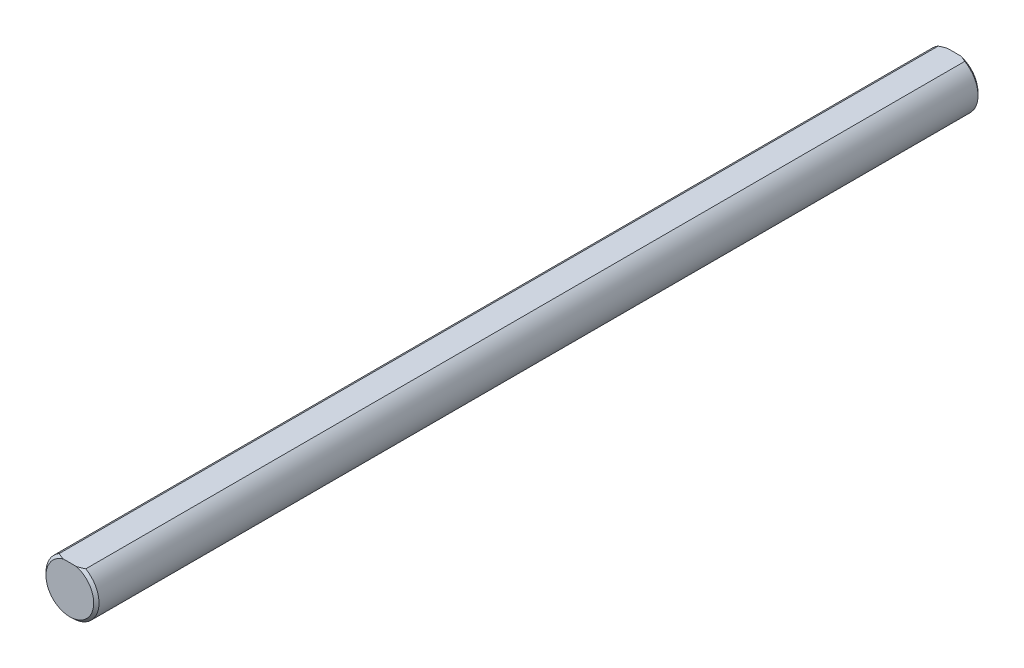
ISO-10303-21;
HEADER;
FILE_DESCRIPTION(('STEP AP214'),'2;1');
FILE_NAME('part.step','',(''),(''),'','','');
FILE_SCHEMA(('AUTOMOTIVE_DESIGN { 1 0 10303 214 1 1 1 1 }'));
ENDSEC;
DATA;
#1=APPLICATION_CONTEXT('core data for automotive mechanical design processes');
#2=APPLICATION_PROTOCOL_DEFINITION('international standard','automotive_design',2000,#1);
#3=PRODUCT_CONTEXT('',#1,'mechanical');
#4=PRODUCT('Part','Part','',(#3));
#5=PRODUCT_RELATED_PRODUCT_CATEGORY('part','',(#4));
#6=PRODUCT_DEFINITION_FORMATION('','',#4);
#7=PRODUCT_DEFINITION_CONTEXT('part definition',#1,'design');
#8=PRODUCT_DEFINITION('design','',#6,#7);
#9=PRODUCT_DEFINITION_SHAPE('','',#8);
#10=(LENGTH_UNIT() NAMED_UNIT(*) SI_UNIT(.MILLI.,.METRE.));
#11=(NAMED_UNIT(*) PLANE_ANGLE_UNIT() SI_UNIT($,.RADIAN.));
#12=(NAMED_UNIT(*) SI_UNIT($,.STERADIAN.) SOLID_ANGLE_UNIT());
#13=UNCERTAINTY_MEASURE_WITH_UNIT(LENGTH_MEASURE(1.E-05),#10,'distance_accuracy_value','');
#14=(GEOMETRIC_REPRESENTATION_CONTEXT(3) GLOBAL_UNCERTAINTY_ASSIGNED_CONTEXT((#13)) GLOBAL_UNIT_ASSIGNED_CONTEXT((#10,
#11,#12)) REPRESENTATION_CONTEXT('',''));
#15=CARTESIAN_POINT('',(0.,0.,0.));
#16=DIRECTION('',(0.,0.,1.));
#17=DIRECTION('',(1.,0.,0.));
#18=AXIS2_PLACEMENT_3D('',#15,#16,#17);
#19=CARTESIAN_POINT('',(0.,0.,100.));
#20=DIRECTION('',(0.,0.,-1.));
#21=DIRECTION('',(-1.,0.,0.));
#22=AXIS2_PLACEMENT_3D('',#19,#20,#21);
#23=CYLINDRICAL_SURFACE('',#22,6.);
#24=DIRECTION('',(0.,0.,1.));
#25=VECTOR('',#24,1.);
#26=CARTESIAN_POINT('',(-3.,5.19615242270663,-100.));
#27=LINE('',#26,#25);
#28=CARTESIAN_POINT('',(-3.,5.19615242270663,-99.4));
#29=VERTEX_POINT('',#28);
#30=CARTESIAN_POINT('',(-3.,5.19615242270663,99.4));
#31=VERTEX_POINT('',#30);
#32=EDGE_CURVE('E79',#29,#31,#27,.T.);
#33=ORIENTED_EDGE('',*,*,#32,.F.);
#34=CARTESIAN_POINT('',(0.,0.,-99.4));
#35=DIRECTION('',(0.,0.,1.));
#36=DIRECTION('',(1.,0.,0.));
#37=AXIS2_PLACEMENT_3D('',#34,#35,#36);
#38=CIRCLE('',#37,6.);
#39=CARTESIAN_POINT('',(3.,5.19615242270663,-99.4));
#40=VERTEX_POINT('',#39);
#41=EDGE_CURVE('E90',#29,#40,#38,.T.);
#42=ORIENTED_EDGE('',*,*,#41,.T.);
#43=DIRECTION('',(0.,0.,1.));
#44=VECTOR('',#43,1.);
#45=CARTESIAN_POINT('',(3.,5.19615242270663,-100.));
#46=LINE('',#45,#44);
#47=CARTESIAN_POINT('',(3.,5.19615242270663,99.4));
#48=VERTEX_POINT('',#47);
#49=EDGE_CURVE('E92',#40,#48,#46,.T.);
#50=ORIENTED_EDGE('',*,*,#49,.T.);
#51=CARTESIAN_POINT('',(0.,0.,99.4));
#52=DIRECTION('',(0.,0.,1.));
#53=DIRECTION('',(1.,0.,0.));
#54=AXIS2_PLACEMENT_3D('',#51,#52,#53);
#55=CIRCLE('',#54,6.);
#56=EDGE_CURVE('E91',#48,#31,#55,.F.);
#57=ORIENTED_EDGE('',*,*,#56,.T.);
#58=EDGE_LOOP('',(#33,#42,#50,#57));
#59=FACE_BOUND('',#58,.T.);
#60=ADVANCED_FACE('F32',(#59),#23,.T.);
#61=CARTESIAN_POINT('',(0.,0.,100.));
#62=DIRECTION('',(0.,0.,1.));
#63=DIRECTION('',(1.,0.,0.));
#64=AXIS2_PLACEMENT_3D('',#61,#62,#63);
#65=PLANE('',#64);
#66=DIRECTION('',(1.,0.,0.));
#67=VECTOR('',#66,1.);
#68=CARTESIAN_POINT('',(-3.,5.19615242270663,100.));
#69=LINE('',#68,#67);
#70=CARTESIAN_POINT('',(-1.46969384566996,5.19615242270663,100.));
#71=VERTEX_POINT('',#70);
#72=CARTESIAN_POINT('',(1.46969384566996,5.19615242270663,100.));
#73=VERTEX_POINT('',#72);
#74=EDGE_CURVE('E133',#71,#73,#69,.T.);
#75=ORIENTED_EDGE('',*,*,#74,.F.);
#76=CARTESIAN_POINT('',(0.,0.,100.));
#77=DIRECTION('',(0.,0.,1.));
#78=DIRECTION('',(1.,0.,0.));
#79=AXIS2_PLACEMENT_3D('',#76,#77,#78);
#80=CIRCLE('',#79,5.40000000000002);
#81=EDGE_CURVE('E11',#71,#73,#80,.T.);
#82=ORIENTED_EDGE('',*,*,#81,.T.);
#83=EDGE_LOOP('',(#75,#82));
#84=FACE_BOUND('',#83,.T.);
#85=ADVANCED_FACE('F126',(#84),#65,.T.);
#86=CARTESIAN_POINT('',(0.,0.,-100.));
#87=DIRECTION('',(0.,0.,1.));
#88=DIRECTION('',(1.,0.,0.));
#89=AXIS2_PLACEMENT_3D('',#86,#87,#88);
#90=PLANE('',#89);
#91=DIRECTION('',(1.,0.,0.));
#92=VECTOR('',#91,1.);
#93=CARTESIAN_POINT('',(-3.,5.19615242270663,-100.));
#94=LINE('',#93,#92);
#95=CARTESIAN_POINT('',(-1.46969384566976,5.19615242270663,-100.));
#96=VERTEX_POINT('',#95);
#97=CARTESIAN_POINT('',(1.46969384566976,5.19615242270663,-100.));
#98=VERTEX_POINT('',#97);
#99=EDGE_CURVE('E81',#96,#98,#94,.T.);
#100=ORIENTED_EDGE('',*,*,#99,.T.);
#101=CARTESIAN_POINT('',(0.,0.,-100.));
#102=DIRECTION('',(0.,0.,1.));
#103=DIRECTION('',(1.,0.,0.));
#104=AXIS2_PLACEMENT_3D('',#101,#102,#103);
#105=CIRCLE('',#104,5.39999999999996);
#106=EDGE_CURVE('E41',#98,#96,#105,.F.);
#107=ORIENTED_EDGE('',*,*,#106,.T.);
#108=EDGE_LOOP('',(#100,#107));
#109=FACE_BOUND('',#108,.T.);
#110=ADVANCED_FACE('F109',(#109),#90,.F.);
#111=CARTESIAN_POINT('',(-3.,5.19615242270663,-100.));
#112=DIRECTION('',(0.,-1.,0.));
#113=DIRECTION('',(0.,0.,-1.));
#114=AXIS2_PLACEMENT_3D('',#111,#112,#113);
#115=PLANE('',#114);
#116=ORIENTED_EDGE('',*,*,#49,.F.);
#117=CARTESIAN_POINT('',(3.,5.19615242270663,-99.4));
#118=CARTESIAN_POINT('',(2.87717511872635,5.19615242270663,-99.4613948015367));
#119=CARTESIAN_POINT('',(2.75320040764777,5.19615242270663,-99.5205705340838));
#120=CARTESIAN_POINT('',(2.50314759830588,5.19615242270663,-99.6334346798586));
#121=CARTESIAN_POINT('',(2.37707534905946,5.19615242270663,-99.6871360888507));
#122=CARTESIAN_POINT('',(2.12237325359043,5.19615242270663,-99.7883313493627));
#123=CARTESIAN_POINT('',(1.99374234399067,5.19615242270663,-99.8358225550881));
#124=CARTESIAN_POINT('',(1.73371135141025,5.19615242270663,-99.9236198978536));
#125=CARTESIAN_POINT('',(1.60230527863078,5.19615242270663,-99.9639082246249));
#126=CARTESIAN_POINT('',(1.46969384566976,5.19615242270663,-100.));
#127=B_SPLINE_CURVE_WITH_KNOTS('',3,(#117,#118,#119,#120,#121,#122,#123,#124,#125,#126),
.UNSPECIFIED.,.F.,.F.,(4,2,2,2,4),(0.,0.411973358320255,0.822944749412015,1.23409066418381,
1.64623955089256),.UNSPECIFIED.);
#128=EDGE_CURVE('E85',#40,#98,#127,.T.);
#129=ORIENTED_EDGE('',*,*,#128,.T.);
#130=ORIENTED_EDGE('',*,*,#99,.F.);
#131=CARTESIAN_POINT('',(-1.46969384566976,5.19615242270663,-100.));
#132=CARTESIAN_POINT('',(-1.60230527863078,5.19615242270663,-99.9639082246249));
#133=CARTESIAN_POINT('',(-1.73371135141026,5.19615242270663,-99.9236198978536));
#134=CARTESIAN_POINT('',(-1.99374234399067,5.19615242270663,-99.8358225550881));
#135=CARTESIAN_POINT('',(-2.12237325359043,5.19615242270663,-99.7883313493627));
#136=CARTESIAN_POINT('',(-2.37707534905946,5.19615242270663,-99.6871360888507));
#137=CARTESIAN_POINT('',(-2.50314759830588,5.19615242270663,-99.6334346798586));
#138=CARTESIAN_POINT('',(-2.75320040764777,5.19615242270663,-99.5205705340838));
#139=CARTESIAN_POINT('',(-2.87717511872635,5.19615242270663,-99.4613948015367));
#140=CARTESIAN_POINT('',(-3.,5.19615242270663,-99.4));
#141=B_SPLINE_CURVE_WITH_KNOTS('',3,(#131,#132,#133,#134,#135,#136,#137,#138,#139,#140),
.UNSPECIFIED.,.F.,.F.,(4,2,2,2,4),(0.,0.412148886708746,0.823294801480541,1.2342661925723,
1.64623955089255),.UNSPECIFIED.);
#142=EDGE_CURVE('E75',#96,#29,#141,.T.);
#143=ORIENTED_EDGE('',*,*,#142,.T.);
#144=ORIENTED_EDGE('',*,*,#32,.T.);
#145=CARTESIAN_POINT('',(-3.,5.19615242270663,99.4));
#146=CARTESIAN_POINT('',(-2.87717511872636,5.19615242270663,99.4613948015368));
#147=CARTESIAN_POINT('',(-2.7532004076478,5.19615242270663,99.5205705340839));
#148=CARTESIAN_POINT('',(-2.50314759830594,5.19615242270663,99.6334346798587));
#149=CARTESIAN_POINT('',(-2.37707534905955,5.19615242270663,99.6871360888508));
#150=CARTESIAN_POINT('',(-2.12237325359055,5.19615242270663,99.7883313493627));
#151=CARTESIAN_POINT('',(-1.9937423439908,5.19615242270663,99.8358225550881));
#152=CARTESIAN_POINT('',(-1.73371135141042,5.19615242270663,99.9236198978536));
#153=CARTESIAN_POINT('',(-1.60230527863096,5.19615242270663,99.9639082246249));
#154=CARTESIAN_POINT('',(-1.46969384566997,5.19615242270663,100.));
#155=B_SPLINE_CURVE_WITH_KNOTS('',3,(#145,#146,#147,#148,#149,#150,#151,#152,#153,#154),
.UNSPECIFIED.,.F.,.F.,(4,2,2,2,4),(0.,0.411973358320201,0.822944749411906,1.23409066418365,
1.64623955089233),.UNSPECIFIED.);
#156=EDGE_CURVE('E55',#31,#71,#155,.T.);
#157=ORIENTED_EDGE('',*,*,#156,.T.);
#158=ORIENTED_EDGE('',*,*,#74,.T.);
#159=CARTESIAN_POINT('',(1.46969384566996,5.19615242270663,100.));
#160=CARTESIAN_POINT('',(1.60230527863096,5.19615242270663,99.9639082246249));
#161=CARTESIAN_POINT('',(1.73371135141042,5.19615242270663,99.9236198978536));
#162=CARTESIAN_POINT('',(1.99374234399079,5.19615242270663,99.8358225550881));
#163=CARTESIAN_POINT('',(2.12237325359054,5.19615242270663,99.7883313493627));
#164=CARTESIAN_POINT('',(2.37707534905955,5.19615242270663,99.6871360888508));
#165=CARTESIAN_POINT('',(2.50314759830594,5.19615242270663,99.6334346798587));
#166=CARTESIAN_POINT('',(2.7532004076478,5.19615242270663,99.5205705340839));
#167=CARTESIAN_POINT('',(2.87717511872636,5.19615242270663,99.4613948015368));
#168=CARTESIAN_POINT('',(3.,5.19615242270663,99.4));
#169=B_SPLINE_CURVE_WITH_KNOTS('',3,(#159,#160,#161,#162,#163,#164,#165,#166,#167,#168),
.UNSPECIFIED.,.F.,.F.,(4,2,2,2,4),(0.,0.412148886708688,0.823294801480432,1.23426619257214,
1.64623955089234),.UNSPECIFIED.);
#170=EDGE_CURVE('E48',#73,#48,#169,.T.);
#171=ORIENTED_EDGE('',*,*,#170,.T.);
#172=EDGE_LOOP('',(#116,#129,#130,#143,#144,#157,#158,#171));
#173=FACE_BOUND('',#172,.T.);
#174=ADVANCED_FACE('F78',(#173),#115,.F.);
#175=CARTESIAN_POINT('',(0.,0.,-99.4));
#176=DIRECTION('',(0.,0.,1.));
#177=DIRECTION('',(1.,0.,0.));
#178=AXIS2_PLACEMENT_3D('',#175,#176,#177);
#179=CONICAL_SURFACE('',#178,6.,0.785398163397445);
#180=ORIENTED_EDGE('',*,*,#142,.F.);
#181=ORIENTED_EDGE('',*,*,#106,.F.);
#182=ORIENTED_EDGE('',*,*,#128,.F.);
#183=ORIENTED_EDGE('',*,*,#41,.F.);
#184=EDGE_LOOP('',(#180,#181,#182,#183));
#185=FACE_BOUND('',#184,.T.);
#186=ADVANCED_FACE('F94',(#185),#179,.T.);
#187=CARTESIAN_POINT('',(0.,0.,100.));
#188=DIRECTION('',(0.,0.,-1.));
#189=DIRECTION('',(-1.,0.,0.));
#190=AXIS2_PLACEMENT_3D('',#187,#188,#189);
#191=CONICAL_SURFACE('',#190,5.40000000000002,0.785398163397456);
#192=ORIENTED_EDGE('',*,*,#156,.F.);
#193=ORIENTED_EDGE('',*,*,#56,.F.);
#194=ORIENTED_EDGE('',*,*,#170,.F.);
#195=ORIENTED_EDGE('',*,*,#81,.F.);
#196=EDGE_LOOP('',(#192,#193,#194,#195));
#197=FACE_BOUND('',#196,.T.);
#198=ADVANCED_FACE('F34',(#197),#191,.T.);
#199=CLOSED_SHELL('',(#60,#85,#110,#174,#186,#198));
#200=MANIFOLD_SOLID_BREP('B2',#199);
#201=ADVANCED_BREP_SHAPE_REPRESENTATION('',(#18,#200),#14);
#202=SHAPE_DEFINITION_REPRESENTATION(#9,#201);
ENDSEC;
END-ISO-10303-21;
